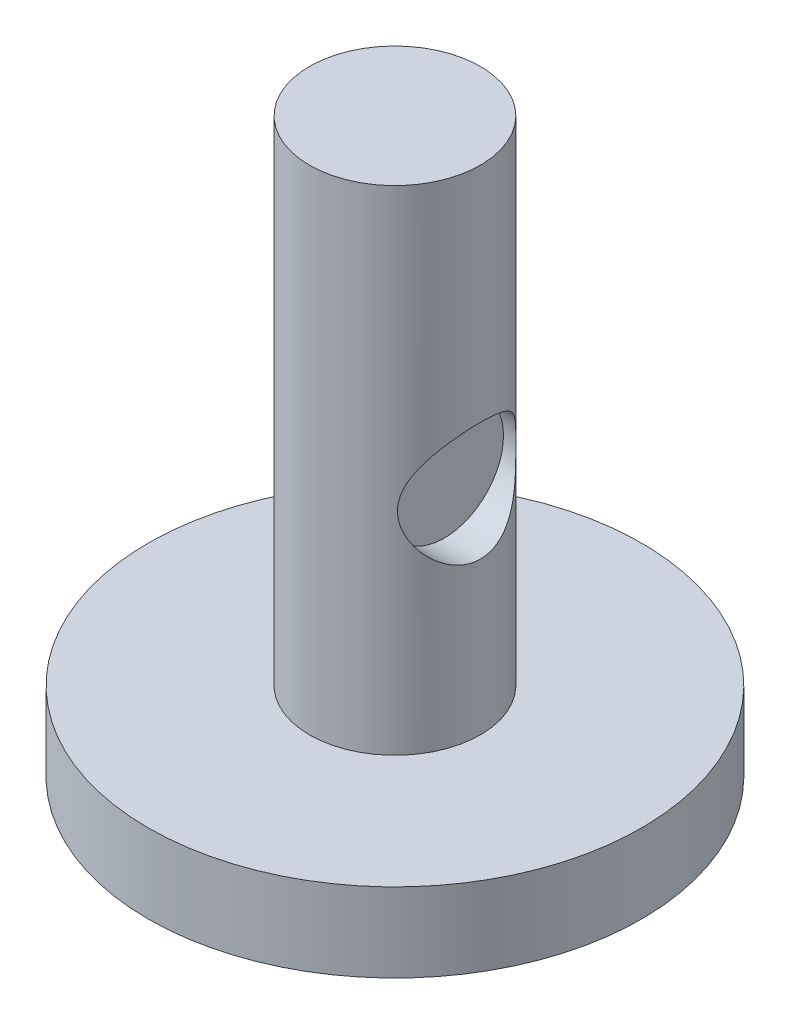
ISO-10303-21;
HEADER;
FILE_DESCRIPTION(('STEP AP214'),'2;1');
FILE_NAME('part.step','',(''),(''),'','','');
FILE_SCHEMA(('AUTOMOTIVE_DESIGN { 1 0 10303 214 1 1 1 1 }'));
ENDSEC;
DATA;
#1=APPLICATION_CONTEXT('core data for automotive mechanical design processes');
#2=APPLICATION_PROTOCOL_DEFINITION('international standard','automotive_design',2000,#1);
#3=PRODUCT_CONTEXT('',#1,'mechanical');
#4=PRODUCT('Part','Part','',(#3));
#5=PRODUCT_RELATED_PRODUCT_CATEGORY('part','',(#4));
#6=PRODUCT_DEFINITION_FORMATION('','',#4);
#7=PRODUCT_DEFINITION_CONTEXT('part definition',#1,'design');
#8=PRODUCT_DEFINITION('design','',#6,#7);
#9=PRODUCT_DEFINITION_SHAPE('','',#8);
#10=(LENGTH_UNIT() NAMED_UNIT(*) SI_UNIT(.MILLI.,.METRE.));
#11=(NAMED_UNIT(*) PLANE_ANGLE_UNIT() SI_UNIT($,.RADIAN.));
#12=(NAMED_UNIT(*) SI_UNIT($,.STERADIAN.) SOLID_ANGLE_UNIT());
#13=UNCERTAINTY_MEASURE_WITH_UNIT(LENGTH_MEASURE(1.E-05),#10,'distance_accuracy_value','');
#14=(GEOMETRIC_REPRESENTATION_CONTEXT(3) GLOBAL_UNCERTAINTY_ASSIGNED_CONTEXT((#13)) GLOBAL_UNIT_ASSIGNED_CONTEXT((#10,
#11,#12)) REPRESENTATION_CONTEXT('',''));
#15=CARTESIAN_POINT('',(0.,0.,0.));
#16=DIRECTION('',(0.,0.,1.));
#17=DIRECTION('',(1.,0.,0.));
#18=AXIS2_PLACEMENT_3D('',#15,#16,#17);
#19=CARTESIAN_POINT('',(0.,8.,0.));
#20=DIRECTION('',(0.,-1.,0.));
#21=DIRECTION('',(0.,0.,-1.));
#22=AXIS2_PLACEMENT_3D('',#19,#20,#21);
#23=CYLINDRICAL_SURFACE('',#22,25.);
#24=CARTESIAN_POINT('',(0.,8.,0.));
#25=DIRECTION('',(0.,1.,0.));
#26=DIRECTION('',(0.,0.,1.));
#27=AXIS2_PLACEMENT_3D('',#24,#25,#26);
#28=CIRCLE('',#27,25.);
#29=CARTESIAN_POINT('',(0.,8.,25.));
#30=VERTEX_POINT('',#29);
#31=EDGE_CURVE('E52',#30,#30,#28,.T.);
#32=ORIENTED_EDGE('',*,*,#31,.F.);
#33=EDGE_LOOP('',(#32));
#34=FACE_BOUND('',#33,.T.);
#35=CARTESIAN_POINT('',(0.,0.,0.));
#36=DIRECTION('',(0.,1.,0.));
#37=DIRECTION('',(0.,0.,1.));
#38=AXIS2_PLACEMENT_3D('',#35,#36,#37);
#39=CIRCLE('',#38,25.);
#40=CARTESIAN_POINT('',(0.,0.,25.));
#41=VERTEX_POINT('',#40);
#42=EDGE_CURVE('E58',#41,#41,#39,.T.);
#43=ORIENTED_EDGE('',*,*,#42,.T.);
#44=EDGE_LOOP('',(#43));
#45=FACE_BOUND('',#44,.T.);
#46=ADVANCED_FACE('F39',(#34,#45),#23,.T.);
#47=CARTESIAN_POINT('',(0.,8.,0.));
#48=DIRECTION('',(0.,1.,0.));
#49=DIRECTION('',(0.,0.,1.));
#50=AXIS2_PLACEMENT_3D('',#47,#48,#49);
#51=PLANE('',#50);
#52=CARTESIAN_POINT('',(0.,8.,0.));
#53=DIRECTION('',(0.,1.,0.));
#54=DIRECTION('',(0.,0.,1.));
#55=AXIS2_PLACEMENT_3D('',#52,#53,#54);
#56=CIRCLE('',#55,8.66497705551748);
#57=CARTESIAN_POINT('',(0.,8.,8.66497705551748));
#58=VERTEX_POINT('',#57);
#59=EDGE_CURVE('E10',#58,#58,#56,.T.);
#60=ORIENTED_EDGE('',*,*,#59,.F.);
#61=EDGE_LOOP('',(#60));
#62=FACE_BOUND('',#61,.T.);
#63=ORIENTED_EDGE('',*,*,#31,.T.);
#64=EDGE_LOOP('',(#63));
#65=FACE_BOUND('',#64,.T.);
#66=ADVANCED_FACE('F95',(#62,#65),#51,.T.);
#67=CARTESIAN_POINT('',(0.,0.,0.));
#68=DIRECTION('',(0.,1.,0.));
#69=DIRECTION('',(0.,0.,1.));
#70=AXIS2_PLACEMENT_3D('',#67,#68,#69);
#71=PLANE('',#70);
#72=ORIENTED_EDGE('',*,*,#42,.F.);
#73=EDGE_LOOP('',(#72));
#74=FACE_BOUND('',#73,.T.);
#75=ADVANCED_FACE('F100',(#74),#71,.F.);
#76=CARTESIAN_POINT('',(0.,58.,0.));
#77=DIRECTION('',(0.,-1.,0.));
#78=DIRECTION('',(0.,0.,-1.));
#79=AXIS2_PLACEMENT_3D('',#76,#77,#78);
#80=CYLINDRICAL_SURFACE('',#79,8.66497705551748);
#81=CARTESIAN_POINT('',(6.25154599860261,29.4299096096552,-6.));
#82=CARTESIAN_POINT('',(6.2515482360774,29.2853330834882,-5.99999873923848));
#83=CARTESIAN_POINT('',(6.25658587338079,29.1407392238309,-5.99476230353495));
#84=CARTESIAN_POINT('',(6.27646825395201,28.852975939373,-5.97394120892526));
#85=CARTESIAN_POINT('',(6.29131477385855,28.7098067773909,-5.95835467534989));
#86=CARTESIAN_POINT('',(6.33008444709654,28.4259449070902,-5.91714915311503));
#87=CARTESIAN_POINT('',(6.35402195060919,28.2852564839532,-5.89151430104892));
#88=CARTESIAN_POINT('',(6.40986805270672,28.007545293754,-5.83070483550885));
#89=CARTESIAN_POINT('',(6.44178092345481,27.8705245350409,-5.7955251082658));
#90=CARTESIAN_POINT('',(6.54676492917149,27.4691951485022,-5.67738485187453));
#91=CARTESIAN_POINT('',(6.62960429092781,27.2111948443079,-5.5813043957237));
#92=CARTESIAN_POINT('',(6.81142092241263,26.7156892093784,-5.35789807499781));
#93=CARTESIAN_POINT('',(6.91039994445262,26.4781861083476,-5.23056881692603));
#94=CARTESIAN_POINT('',(7.13352332193085,25.9858796817886,-4.92307168012018));
#95=CARTESIAN_POINT('',(7.25908104561259,25.7350307658642,-4.73759633605385));
#96=CARTESIAN_POINT('',(7.50956732745034,25.2644026365798,-4.32961573589911));
#97=CARTESIAN_POINT('',(7.63449495473571,25.0446609001309,-4.10706650502244));
#98=CARTESIAN_POINT('',(7.82362426582867,24.7250025759216,-3.72787718334471));
#99=CARTESIAN_POINT('',(7.89134864006631,24.6134413279793,-3.58266211558608));
#100=CARTESIAN_POINT('',(8.02148735411409,24.4030532551174,-3.28093461658711));
#101=CARTESIAN_POINT('',(8.08390074398438,24.3042287067053,-3.12442017351894));
#102=CARTESIAN_POINT('',(8.20152744138461,24.1206558350104,-2.80112945101535));
#103=CARTESIAN_POINT('',(8.25675201046457,24.0358854369627,-2.63436983934029));
#104=CARTESIAN_POINT('',(8.35841448376999,23.8815186861772,-2.29143485569573));
#105=CARTESIAN_POINT('',(8.40485610088338,23.8119159196012,-2.11526350300279));
#106=CARTESIAN_POINT('',(8.47648514706436,23.7053937536346,-1.80264398579649));
#107=CARTESIAN_POINT('',(8.50404536110724,23.6646988815535,-1.66801210259682));
#108=CARTESIAN_POINT('',(8.55303910394138,23.5926714171159,-1.39518541777051));
#109=CARTESIAN_POINT('',(8.57447390173759,23.5613368855129,-1.25699136059787));
#110=CARTESIAN_POINT('',(8.61075869731498,23.5084479831981,-0.977978442639002));
#111=CARTESIAN_POINT('',(8.62561276441314,23.4868875682872,-0.837161260212782));
#112=CARTESIAN_POINT('',(8.64843048276235,23.4538184031879,-0.553787834890268));
#113=CARTESIAN_POINT('',(8.65639390213605,23.4423099912596,-0.411231533634537));
#114=CARTESIAN_POINT('',(8.66525666982298,23.429504012541,-0.125174117060306));
#115=CARTESIAN_POINT('',(8.66614285642322,23.4282254704962,0.0183282621317837));
#116=CARTESIAN_POINT('',(8.66079626366645,23.4359482980386,0.304921206979796));
#117=CARTESIAN_POINT('',(8.65456351089749,23.4449496292321,0.448011774171766));
#118=CARTESIAN_POINT('',(8.63512109018894,23.4730990299947,0.732715075935375));
#119=CARTESIAN_POINT('',(8.62191110667333,23.4922475585156,0.874327743367021));
#120=CARTESIAN_POINT('',(8.58880259158253,23.5404267596718,1.15511639076017));
#121=CARTESIAN_POINT('',(8.56890148543844,23.5694612362158,1.29429141105908));
#122=CARTESIAN_POINT('',(8.52333358682664,23.6362947207299,1.56627130277669));
#123=CARTESIAN_POINT('',(8.49780112722546,23.6738900988296,1.69914886257262));
#124=CARTESIAN_POINT('',(8.44123381128059,23.7577361245334,1.96096108983885));
#125=CARTESIAN_POINT('',(8.41019702385479,23.8039898100465,2.08989435485902));
#126=CARTESIAN_POINT('',(8.30966869040201,23.9550159128408,2.4697521389911));
#127=CARTESIAN_POINT('',(8.2327239088105,24.0721041200096,2.71393762861341));
#128=CARTESIAN_POINT('',(8.0545321475119,24.3499216160749,3.20665442227638));
#129=CARTESIAN_POINT('',(7.95152505507005,24.5140784999717,3.45258453537196));
#130=CARTESIAN_POINT('',(7.73427857526588,24.8738282305174,3.9151066852993));
#131=CARTESIAN_POINT('',(7.62002680554794,25.0694558857981,4.13166574134957));
#132=CARTESIAN_POINT('',(7.43596274202168,25.4022309384458,4.45049753372501));
#133=CARTESIAN_POINT('',(7.36723243309104,25.5302707550141,4.56309986466251));
#134=CARTESIAN_POINT('',(7.23025314985604,25.7956732423109,4.77717444286825));
#135=CARTESIAN_POINT('',(7.16200427498323,25.9330377800571,4.8786444504931));
#136=CARTESIAN_POINT('',(7.02787959410407,26.2166775101315,5.06994867982672));
#137=CARTESIAN_POINT('',(6.96200292534914,26.3629494097729,5.15978716330183));
#138=CARTESIAN_POINT('',(6.83468103560271,26.6641021277637,5.32729160888045));
#139=CARTESIAN_POINT('',(6.7732359878026,26.8189832821515,5.40495709539222));
#140=CARTESIAN_POINT('',(6.62621475226547,27.2217014557387,5.58523848433843));
#141=CARTESIAN_POINT('',(6.54512950998862,27.4752632844001,5.67923313710491));
#142=CARTESIAN_POINT('',(6.44254262251781,27.8677053067592,5.79466395858612));
#143=CARTESIAN_POINT('',(6.41152812105002,28.0004866011998,5.82887309602364));
#144=CARTESIAN_POINT('',(6.35696378348546,28.2695303015936,5.8883332257527));
#145=CARTESIAN_POINT('',(6.33341049778856,28.4057910672753,5.91358835846243));
#146=CARTESIAN_POINT('',(6.29458963267648,28.6822833921852,5.95489606088518));
#147=CARTESIAN_POINT('',(6.27940628454293,28.822540891964,5.97085516711369));
#148=CARTESIAN_POINT('',(6.25842887194203,29.1045399384383,5.99283987657252));
#149=CARTESIAN_POINT('',(6.25263452955407,29.2462814410814,5.9988657738323));
#150=CARTESIAN_POINT('',(6.25073737124726,29.5298753643994,6.0008425809899));
#151=CARTESIAN_POINT('',(6.25463291466766,29.6717277622324,5.99679519646377));
#152=CARTESIAN_POINT('',(6.27190830560066,29.9542020396635,5.97872460750543));
#153=CARTESIAN_POINT('',(6.28528783256718,30.0948239606875,5.96470174023124));
#154=CARTESIAN_POINT('',(6.3185494832066,30.3555056033322,5.92944003353417));
#155=CARTESIAN_POINT('',(6.33736191975397,30.4758647250155,5.9093743368018));
#156=CARTESIAN_POINT('',(6.38100547030307,30.7140960311307,5.86222030569136));
#157=CARTESIAN_POINT('',(6.40583831347963,30.8319674904665,5.83512995354337));
#158=CARTESIAN_POINT('',(6.48827591142343,31.1811996047624,5.7437654280388));
#159=CARTESIAN_POINT('',(6.55381613155109,31.4081519249144,5.66940141076166));
#160=CARTESIAN_POINT('',(6.68000688914559,31.7886871950853,5.5196181237116));
#161=CARTESIAN_POINT('',(6.73729784950909,31.9456919513883,5.44977222825479));
#162=CARTESIAN_POINT('',(6.85737450901907,32.2515242964626,5.29788765449348));
#163=CARTESIAN_POINT('',(6.920160662762,32.4003512070508,5.2158479670502));
#164=CARTESIAN_POINT('',(7.04921017104574,32.6897177745952,5.04007656638999));
#165=CARTESIAN_POINT('',(7.1154795303274,32.8302421700613,4.94632425135335));
#166=CARTESIAN_POINT('',(7.24949817231071,33.102431841045,4.74773192214705));
#167=CARTESIAN_POINT('',(7.31724728635291,33.234098119285,4.64289316640871));
#168=CARTESIAN_POINT('',(7.45368404370241,33.4903956798925,4.42059961723255));
#169=CARTESIAN_POINT('',(7.52236815944469,33.6148701355102,4.3029612951634));
#170=CARTESIAN_POINT('',(7.65787345586037,33.8538064989328,4.05691753342033));
#171=CARTESIAN_POINT('',(7.72469395768347,33.9682647898275,3.92850823678375));
#172=CARTESIAN_POINT('',(7.91976497621355,34.2952528826126,3.52802379430484));
#173=CARTESIAN_POINT('',(8.04298605635472,34.4920502887042,3.24012693744988));
#174=CARTESIAN_POINT('',(8.24517594279333,34.8069947026024,2.6781556073258));
#175=CARTESIAN_POINT('',(8.32809859338758,34.9327887940781,2.40980801390911));
#176=CARTESIAN_POINT('',(8.43424176476793,35.0917230181753,1.9915274396179));
#177=CARTESIAN_POINT('',(8.46658876704775,35.1397502830813,1.84943477934835));
#178=CARTESIAN_POINT('',(8.52451406555824,35.2252967032158,1.560804809609));
#179=CARTESIAN_POINT('',(8.55009524296231,35.262820331734,1.41426942176741));
#180=CARTESIAN_POINT('',(8.59401799817688,35.3270163358547,1.1168748767967));
#181=CARTESIAN_POINT('',(8.61231736132025,35.3536254637263,0.965995793648274));
#182=CARTESIAN_POINT('',(8.6410093092252,35.3952631771145,0.661894955150648));
#183=CARTESIAN_POINT('',(8.65140186956437,35.4102917268612,0.508673192566901));
#184=CARTESIAN_POINT('',(8.66400593713,35.428510672056,0.201229608775234));
#185=CARTESIAN_POINT('',(8.66621952572612,35.43170407929,0.0470080520018003));
#186=CARTESIAN_POINT('',(8.66241193059342,35.4262049320787,-0.261113965453761));
#187=CARTESIAN_POINT('',(8.65639130168887,35.4175131784594,-0.415014447070268));
#188=CARTESIAN_POINT('',(8.63719666795065,35.3897273857203,-0.707179237154356));
#189=CARTESIAN_POINT('',(8.62472555231736,35.3716549457477,-0.845588865576729));
#190=CARTESIAN_POINT('',(8.59338043950186,35.3260637686065,-1.1201515924278));
#191=CARTESIAN_POINT('',(8.57450429854818,35.298541868653,-1.25630391931036));
#192=CARTESIAN_POINT('',(8.53073752797703,35.2344083981805,-1.52542424015415));
#193=CARTESIAN_POINT('',(8.50584842846646,35.1977991400404,-1.65839303477712));
#194=CARTESIAN_POINT('',(8.45053736411132,35.1159150346846,-1.92047415630252));
#195=CARTESIAN_POINT('',(8.42011326441973,35.0706368435112,-2.04958497273619));
#196=CARTESIAN_POINT('',(8.31867597240278,34.9184862996196,-2.44041407997176));
#197=CARTESIAN_POINT('',(8.23930661967803,34.7978952096897,-2.69479207036811));
#198=CARTESIAN_POINT('',(8.06452503132075,34.5255570780419,-3.17993201635784));
#199=CARTESIAN_POINT('',(7.9691094486606,34.3738035347927,-3.41068902874537));
#200=CARTESIAN_POINT('',(7.7522892702113,34.0167827266407,-3.88083559071539));
#201=CARTESIAN_POINT('',(7.62915678887523,33.8068536603734,-4.11588465095237));
#202=CARTESIAN_POINT('',(7.37853287019488,33.3537751607532,-4.54994252774377));
#203=CARTESIAN_POINT('',(7.2510324875322,33.1105540682225,-4.74887138821088));
#204=CARTESIAN_POINT('',(7.05576559812954,32.7038748782224,-5.03127885661437));
#205=CARTESIAN_POINT('',(6.9856580253201,32.5504912694302,-5.12787456387937));
#206=CARTESIAN_POINT('',(6.85009979374793,32.2339279305868,-5.30759931460486));
#207=CARTESIAN_POINT('',(6.78465048459955,32.0707453865848,-5.39072446414606));
#208=CARTESIAN_POINT('',(6.66136643228402,31.7355939914782,-5.54234182971733));
#209=CARTESIAN_POINT('',(6.60350955232948,31.5636528086255,-5.61087696575224));
#210=CARTESIAN_POINT('',(6.49824205464692,31.2113401987825,-5.73246532402246));
#211=CARTESIAN_POINT('',(6.45082330876044,31.0309754648214,-5.78553060313035));
#212=CARTESIAN_POINT('',(6.38490881453729,30.7328567346415,-5.85800063179456));
#213=CARTESIAN_POINT('',(6.36225908637038,30.6172446521238,-5.88254358587536));
#214=CARTESIAN_POINT('',(6.32285831731099,30.3838111390248,-5.92487382648446));
#215=CARTESIAN_POINT('',(6.30610560086488,30.2659903460555,-5.94266303210921));
#216=CARTESIAN_POINT('',(6.27906853254134,30.0288544801758,-5.97122388688312));
#217=CARTESIAN_POINT('',(6.26877905410181,29.9095406683264,-5.98200109810489));
#218=CARTESIAN_POINT('',(6.25501782727724,29.670124939579,-5.99638865914012));
#219=CARTESIAN_POINT('',(6.25154413971678,29.5500232565999,-6.00000104743604));
#220=CARTESIAN_POINT('',(6.25154599860261,29.4299096096552,-6.));
#221=B_SPLINE_CURVE_WITH_KNOTS('',3,(#81,#82,#83,#84,#85,#86,#87,#88,#89,#90,#91,#92,#93,#94,
#95,#96,#97,#98,#99,#100,#101,#102,#103,#104,#105,#106,#107,#108,#109,#110,#111,#112,#113,#114,
#115,#116,#117,#118,#119,#120,#121,#122,#123,#124,#125,#126,#127,#128,#129,#130,#131,#132,#133,
#134,#135,#136,#137,#138,#139,#140,#141,#142,#143,#144,#145,#146,#147,#148,#149,#150,#151,#152,
#153,#154,#155,#156,#157,#158,#159,#160,#161,#162,#163,#164,#165,#166,#167,#168,#169,#170,#171,
#172,#173,#174,#175,#176,#177,#178,#179,#180,#181,#182,#183,#184,#185,#186,#187,#188,#189,#190,
#191,#192,#193,#194,#195,#196,#197,#198,#199,#200,#201,#202,#203,#204,#205,#206,#207,#208,#209,
#210,#211,#212,#213,#214,#215,#216,#217,#218,#219,#220),.UNSPECIFIED.,.T.,.F.,(4,2,2,2,2,2,2,2,
2,2,2,2,2,2,2,2,2,2,2,2,2,2,2,2,2,2,2,2,2,2,2,2,2,2,2,2,2,2,2,2,2,2,2,2,2,2,2,2,2,2,2,2,2,2,2,2,
2,2,2,2,2,2,2,2,2,2,2,2,2,4),(0.,0.433580459478281,0.867239472969798,1.30158588474537,
1.73616546335324,2.5949523601094,3.4538325590371,4.45914944971693,5.46566738926623,
6.0507049384061,6.63584691026265,7.22006091265072,7.80402739078297,8.23355578605314,
8.66299513113461,9.09216855250355,9.52135641543472,9.95134226470636,10.3813265080578,
10.8113302010082,11.2414995378375,11.662344177865,12.0833367558506,12.9246921051206,
13.8606936529445,14.7977376862022,15.3487667794345,15.8999065283026,16.4508437657687,
17.0018025226619,17.8450451688842,18.2663675947385,18.6874949421567,19.1127863656648,
19.538065200044,19.9632720324612,20.3884644941365,20.7584571175383,21.1285561359917,
21.8688330817782,22.4116325691776,22.9544770028343,23.4982900781032,24.0420414908127,
24.5949979258865,25.1481532206191,26.2516851525805,27.1708460179868,27.6306673165981,
28.0902924874924,28.5525447117638,29.0147983638274,29.4769343743284,29.9390392474878,
30.358976350772,30.7790541464962,31.1990251581563,31.6191584971849,32.492925281236,
33.3668745478492,34.3781415379832,35.3916204920873,35.9740362551086,36.5566200772472,
37.1374656547538,37.7178573160145,38.0785658633574,38.4391718375112,38.7994914209872,
39.1597084742846),.UNSPECIFIED.);
#222=CARTESIAN_POINT('',(6.25154599860261,29.4299096096552,-6.));
#223=VERTEX_POINT('',#222);
#224=EDGE_CURVE('E42',#223,#223,#221,.T.);
#225=ORIENTED_EDGE('',*,*,#224,.T.);
#226=EDGE_LOOP('',(#225));
#227=FACE_BOUND('',#226,.T.);
#228=CARTESIAN_POINT('',(0.,58.,0.));
#229=DIRECTION('',(0.,1.,0.));
#230=DIRECTION('',(0.,0.,1.));
#231=AXIS2_PLACEMENT_3D('',#228,#229,#230);
#232=CIRCLE('',#231,8.66497705551748);
#233=CARTESIAN_POINT('',(0.,58.,8.66497705551748));
#234=VERTEX_POINT('',#233);
#235=EDGE_CURVE('E61',#234,#234,#232,.T.);
#236=ORIENTED_EDGE('',*,*,#235,.F.);
#237=EDGE_LOOP('',(#236));
#238=FACE_BOUND('',#237,.T.);
#239=ORIENTED_EDGE('',*,*,#59,.T.);
#240=EDGE_LOOP('',(#239));
#241=FACE_BOUND('',#240,.T.);
#242=ADVANCED_FACE('F91',(#227,#238,#241),#80,.T.);
#243=CARTESIAN_POINT('',(0.,58.,0.));
#244=DIRECTION('',(0.,1.,0.));
#245=DIRECTION('',(0.,0.,1.));
#246=AXIS2_PLACEMENT_3D('',#243,#244,#245);
#247=PLANE('',#246);
#248=ORIENTED_EDGE('',*,*,#235,.T.);
#249=EDGE_LOOP('',(#248));
#250=FACE_BOUND('',#249,.T.);
#251=ADVANCED_FACE('F85',(#250),#247,.T.);
#252=CARTESIAN_POINT('',(5.00000000000001,29.4299096096552,0.));
#253=DIRECTION('',(1.,0.,0.));
#254=DIRECTION('',(0.,0.,-1.));
#255=AXIS2_PLACEMENT_3D('',#252,#253,#254);
#256=CYLINDRICAL_SURFACE('',#255,6.);
#257=CARTESIAN_POINT('',(5.00000000000001,29.4299096096552,0.));
#258=DIRECTION('',(1.,0.,0.));
#259=DIRECTION('',(0.,0.,-1.));
#260=AXIS2_PLACEMENT_3D('',#257,#258,#259);
#261=CIRCLE('',#260,6.);
#262=CARTESIAN_POINT('',(5.00000000000001,29.4299096096552,-6.));
#263=VERTEX_POINT('',#262);
#264=EDGE_CURVE('E73',#263,#263,#261,.T.);
#265=ORIENTED_EDGE('',*,*,#264,.F.);
#266=EDGE_LOOP('',(#265));
#267=FACE_BOUND('',#266,.T.);
#268=ORIENTED_EDGE('',*,*,#224,.F.);
#269=EDGE_LOOP('',(#268));
#270=FACE_BOUND('',#269,.T.);
#271=ADVANCED_FACE('F82',(#267,#270),#256,.F.);
#272=CARTESIAN_POINT('',(5.00000000000001,29.4299096096552,0.));
#273=DIRECTION('',(1.,0.,0.));
#274=DIRECTION('',(0.,0.,-1.));
#275=AXIS2_PLACEMENT_3D('',#272,#273,#274);
#276=PLANE('',#275);
#277=ORIENTED_EDGE('',*,*,#264,.T.);
#278=EDGE_LOOP('',(#277));
#279=FACE_BOUND('',#278,.T.);
#280=ADVANCED_FACE('F80',(#279),#276,.T.);
#281=CLOSED_SHELL('',(#46,#66,#75,#242,#251,#271,#280));
#282=MANIFOLD_SOLID_BREP('B2',#281);
#283=ADVANCED_BREP_SHAPE_REPRESENTATION('',(#18,#282),#14);
#284=SHAPE_DEFINITION_REPRESENTATION(#9,#283);
ENDSEC;
END-ISO-10303-21;
